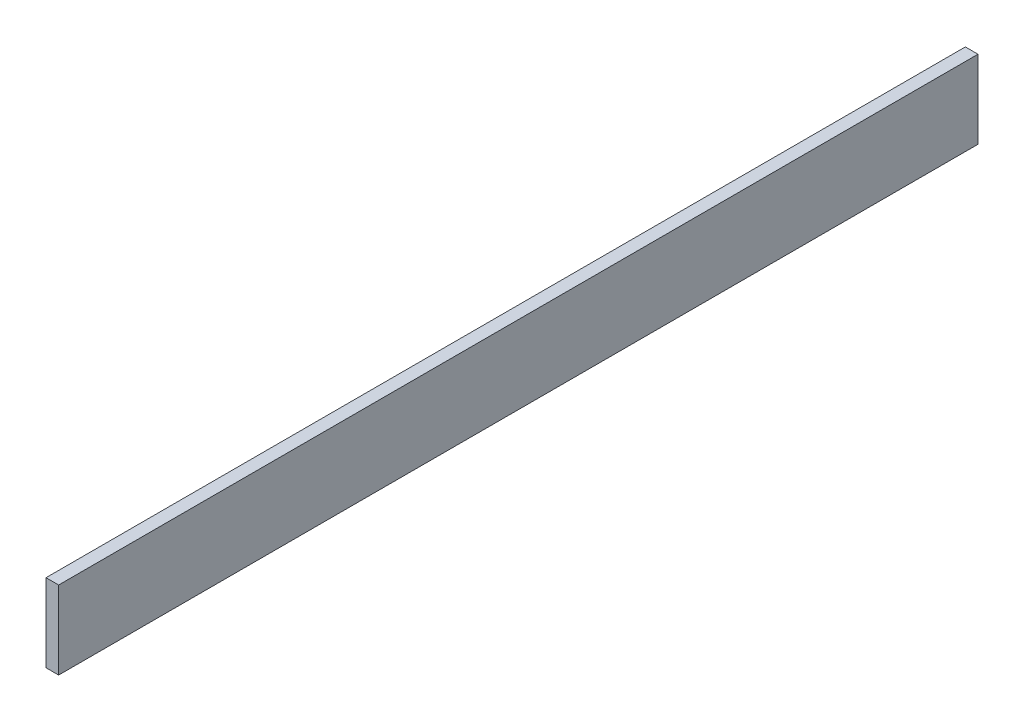
ISO-10303-21;
HEADER;
FILE_DESCRIPTION(('STEP AP214'),'2;1');
FILE_NAME('part.step','',(''),(''),'','','');
FILE_SCHEMA(('AUTOMOTIVE_DESIGN { 1 0 10303 214 1 1 1 1 }'));
ENDSEC;
DATA;
#1=APPLICATION_CONTEXT('core data for automotive mechanical design processes');
#2=APPLICATION_PROTOCOL_DEFINITION('international standard','automotive_design',2000,#1);
#3=PRODUCT_CONTEXT('',#1,'mechanical');
#4=PRODUCT('Part','Part','',(#3));
#5=PRODUCT_RELATED_PRODUCT_CATEGORY('part','',(#4));
#6=PRODUCT_DEFINITION_FORMATION('','',#4);
#7=PRODUCT_DEFINITION_CONTEXT('part definition',#1,'design');
#8=PRODUCT_DEFINITION('design','',#6,#7);
#9=PRODUCT_DEFINITION_SHAPE('','',#8);
#10=(LENGTH_UNIT() NAMED_UNIT(*) SI_UNIT(.MILLI.,.METRE.));
#11=(NAMED_UNIT(*) PLANE_ANGLE_UNIT() SI_UNIT($,.RADIAN.));
#12=(NAMED_UNIT(*) SI_UNIT($,.STERADIAN.) SOLID_ANGLE_UNIT());
#13=UNCERTAINTY_MEASURE_WITH_UNIT(LENGTH_MEASURE(1.E-05),#10,'distance_accuracy_value','');
#14=(GEOMETRIC_REPRESENTATION_CONTEXT(3) GLOBAL_UNCERTAINTY_ASSIGNED_CONTEXT((#13)) GLOBAL_UNIT_ASSIGNED_CONTEXT((#10,
#11,#12)) REPRESENTATION_CONTEXT('',''));
#15=CARTESIAN_POINT('',(0.,0.,0.));
#16=DIRECTION('',(0.,0.,1.));
#17=DIRECTION('',(1.,0.,0.));
#18=AXIS2_PLACEMENT_3D('',#15,#16,#17);
#19=CARTESIAN_POINT('',(38.1,114.486069551587,416.094141436133));
#20=DIRECTION('',(0.,0.,-1.));
#21=DIRECTION('',(-1.,0.,0.));
#22=AXIS2_PLACEMENT_3D('',#19,#20,#21);
#23=PLANE('',#22);
#24=DIRECTION('',(0.,-1.,0.));
#25=VECTOR('',#24,1.);
#26=CARTESIAN_POINT('',(0.,114.486069551587,416.094141436133));
#27=LINE('',#26,#25);
#28=CARTESIAN_POINT('',(0.,349.436069551587,416.094141436133));
#29=VERTEX_POINT('',#28);
#30=CARTESIAN_POINT('',(0.,114.486069551587,416.094141436133));
#31=VERTEX_POINT('',#30);
#32=EDGE_CURVE('E96',#29,#31,#27,.T.);
#33=ORIENTED_EDGE('',*,*,#32,.T.);
#34=DIRECTION('',(-1.,0.,0.));
#35=VECTOR('',#34,1.);
#36=CARTESIAN_POINT('',(38.1,114.486069551587,416.094141436133));
#37=LINE('',#36,#35);
#38=CARTESIAN_POINT('',(38.1,114.486069551587,416.094141436133));
#39=VERTEX_POINT('',#38);
#40=EDGE_CURVE('E11',#39,#31,#37,.T.);
#41=ORIENTED_EDGE('',*,*,#40,.F.);
#42=DIRECTION('',(0.,-1.,0.));
#43=VECTOR('',#42,1.);
#44=CARTESIAN_POINT('',(38.1,114.486069551587,416.094141436133));
#45=LINE('',#44,#43);
#46=CARTESIAN_POINT('',(38.1,349.436069551587,416.094141436133));
#47=VERTEX_POINT('',#46);
#48=EDGE_CURVE('E84',#47,#39,#45,.T.);
#49=ORIENTED_EDGE('',*,*,#48,.F.);
#50=DIRECTION('',(-1.,0.,0.));
#51=VECTOR('',#50,1.);
#52=CARTESIAN_POINT('',(38.1,349.436069551587,416.094141436133));
#53=LINE('',#52,#51);
#54=EDGE_CURVE('E92',#47,#29,#53,.T.);
#55=ORIENTED_EDGE('',*,*,#54,.T.);
#56=EDGE_LOOP('',(#33,#41,#49,#55));
#57=FACE_BOUND('',#56,.T.);
#58=ADVANCED_FACE('F33',(#57),#23,.F.);
#59=CARTESIAN_POINT('',(38.1,114.486069551587,416.094141436133));
#60=DIRECTION('',(0.,1.,0.));
#61=DIRECTION('',(0.,0.,1.));
#62=AXIS2_PLACEMENT_3D('',#59,#60,#61);
#63=PLANE('',#62);
#64=DIRECTION('',(0.,0.,-1.));
#65=VECTOR('',#64,1.);
#66=CARTESIAN_POINT('',(0.,114.486069551587,416.094141436133));
#67=LINE('',#66,#65);
#68=CARTESIAN_POINT('',(0.,114.486069551587,-2352.50585856387));
#69=VERTEX_POINT('',#68);
#70=EDGE_CURVE('E88',#31,#69,#67,.T.);
#71=ORIENTED_EDGE('',*,*,#70,.T.);
#72=DIRECTION('',(-1.,0.,0.));
#73=VECTOR('',#72,1.);
#74=CARTESIAN_POINT('',(38.1,114.486069551587,-2352.50585856387));
#75=LINE('',#74,#73);
#76=CARTESIAN_POINT('',(38.1,114.486069551587,-2352.50585856387));
#77=VERTEX_POINT('',#76);
#78=EDGE_CURVE('E41',#77,#69,#75,.T.);
#79=ORIENTED_EDGE('',*,*,#78,.F.);
#80=DIRECTION('',(0.,0.,-1.));
#81=VECTOR('',#80,1.);
#82=CARTESIAN_POINT('',(38.1,114.486069551587,416.094141436133));
#83=LINE('',#82,#81);
#84=EDGE_CURVE('E79',#39,#77,#83,.T.);
#85=ORIENTED_EDGE('',*,*,#84,.F.);
#86=ORIENTED_EDGE('',*,*,#40,.T.);
#87=EDGE_LOOP('',(#71,#79,#85,#86));
#88=FACE_BOUND('',#87,.T.);
#89=ADVANCED_FACE('F87',(#88),#63,.F.);
#90=CARTESIAN_POINT('',(38.1,114.486069551587,-2352.50585856387));
#91=DIRECTION('',(0.,0.,1.));
#92=DIRECTION('',(1.,0.,0.));
#93=AXIS2_PLACEMENT_3D('',#90,#91,#92);
#94=PLANE('',#93);
#95=DIRECTION('',(0.,1.,0.));
#96=VECTOR('',#95,1.);
#97=CARTESIAN_POINT('',(0.,114.486069551587,-2352.50585856387));
#98=LINE('',#97,#96);
#99=CARTESIAN_POINT('',(0.,349.436069551587,-2352.50585856387));
#100=VERTEX_POINT('',#99);
#101=EDGE_CURVE('E66',#69,#100,#98,.T.);
#102=ORIENTED_EDGE('',*,*,#101,.T.);
#103=DIRECTION('',(-1.,0.,0.));
#104=VECTOR('',#103,1.);
#105=CARTESIAN_POINT('',(38.1,349.436069551587,-2352.50585856387));
#106=LINE('',#105,#104);
#107=CARTESIAN_POINT('',(38.1,349.436069551587,-2352.50585856387));
#108=VERTEX_POINT('',#107);
#109=EDGE_CURVE('E89',#108,#100,#106,.T.);
#110=ORIENTED_EDGE('',*,*,#109,.F.);
#111=DIRECTION('',(0.,1.,0.));
#112=VECTOR('',#111,1.);
#113=CARTESIAN_POINT('',(38.1,114.486069551587,-2352.50585856387));
#114=LINE('',#113,#112);
#115=EDGE_CURVE('E82',#77,#108,#114,.T.);
#116=ORIENTED_EDGE('',*,*,#115,.F.);
#117=ORIENTED_EDGE('',*,*,#78,.T.);
#118=EDGE_LOOP('',(#102,#110,#116,#117));
#119=FACE_BOUND('',#118,.T.);
#120=ADVANCED_FACE('F90',(#119),#94,.F.);
#121=CARTESIAN_POINT('',(38.1,349.436069551587,416.094141436133));
#122=DIRECTION('',(0.,-1.,0.));
#123=DIRECTION('',(0.,0.,-1.));
#124=AXIS2_PLACEMENT_3D('',#121,#122,#123);
#125=PLANE('',#124);
#126=DIRECTION('',(0.,0.,1.));
#127=VECTOR('',#126,1.);
#128=CARTESIAN_POINT('',(0.,349.436069551587,416.094141436133));
#129=LINE('',#128,#127);
#130=EDGE_CURVE('E72',#100,#29,#129,.T.);
#131=ORIENTED_EDGE('',*,*,#130,.T.);
#132=ORIENTED_EDGE('',*,*,#54,.F.);
#133=DIRECTION('',(0.,0.,1.));
#134=VECTOR('',#133,1.);
#135=CARTESIAN_POINT('',(38.1,349.436069551587,416.094141436133));
#136=LINE('',#135,#134);
#137=EDGE_CURVE('E49',#108,#47,#136,.T.);
#138=ORIENTED_EDGE('',*,*,#137,.F.);
#139=ORIENTED_EDGE('',*,*,#109,.T.);
#140=EDGE_LOOP('',(#131,#132,#138,#139));
#141=FACE_BOUND('',#140,.T.);
#142=ADVANCED_FACE('F103',(#141),#125,.F.);
#143=CARTESIAN_POINT('',(38.1,0.,0.));
#144=DIRECTION('',(-1.,0.,0.));
#145=DIRECTION('',(0.,0.,1.));
#146=AXIS2_PLACEMENT_3D('',#143,#144,#145);
#147=PLANE('',#146);
#148=ORIENTED_EDGE('',*,*,#48,.T.);
#149=ORIENTED_EDGE('',*,*,#84,.T.);
#150=ORIENTED_EDGE('',*,*,#115,.T.);
#151=ORIENTED_EDGE('',*,*,#137,.T.);
#152=EDGE_LOOP('',(#148,#149,#150,#151));
#153=FACE_BOUND('',#152,.T.);
#154=ADVANCED_FACE('F80',(#153),#147,.F.);
#155=CARTESIAN_POINT('',(0.,0.,0.));
#156=DIRECTION('',(-1.,0.,0.));
#157=DIRECTION('',(0.,0.,1.));
#158=AXIS2_PLACEMENT_3D('',#155,#156,#157);
#159=PLANE('',#158);
#160=ORIENTED_EDGE('',*,*,#32,.F.);
#161=ORIENTED_EDGE('',*,*,#130,.F.);
#162=ORIENTED_EDGE('',*,*,#101,.F.);
#163=ORIENTED_EDGE('',*,*,#70,.F.);
#164=EDGE_LOOP('',(#160,#161,#162,#163));
#165=FACE_BOUND('',#164,.T.);
#166=ADVANCED_FACE('F106',(#165),#159,.T.);
#167=CLOSED_SHELL('',(#58,#89,#120,#142,#154,#166));
#168=MANIFOLD_SOLID_BREP('B2',#167);
#169=ADVANCED_BREP_SHAPE_REPRESENTATION('',(#18,#168),#14);
#170=SHAPE_DEFINITION_REPRESENTATION(#9,#169);
ENDSEC;
END-ISO-10303-21;
